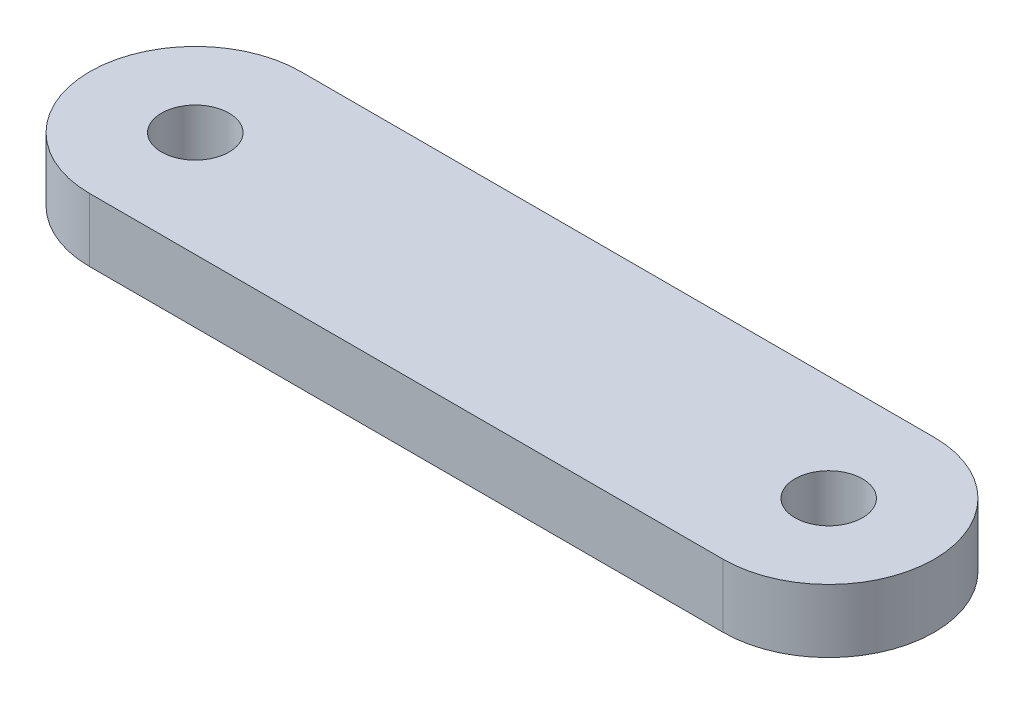
ISO-10303-21;
HEADER;
FILE_DESCRIPTION(('STEP AP214'),'2;1');
FILE_NAME('part.step','',(''),(''),'','','');
FILE_SCHEMA(('AUTOMOTIVE_DESIGN { 1 0 10303 214 1 1 1 1 }'));
ENDSEC;
DATA;
#1=APPLICATION_CONTEXT('core data for automotive mechanical design processes');
#2=APPLICATION_PROTOCOL_DEFINITION('international standard','automotive_design',2000,#1);
#3=PRODUCT_CONTEXT('',#1,'mechanical');
#4=PRODUCT('Part','Part','',(#3));
#5=PRODUCT_RELATED_PRODUCT_CATEGORY('part','',(#4));
#6=PRODUCT_DEFINITION_FORMATION('','',#4);
#7=PRODUCT_DEFINITION_CONTEXT('part definition',#1,'design');
#8=PRODUCT_DEFINITION('design','',#6,#7);
#9=PRODUCT_DEFINITION_SHAPE('','',#8);
#10=(LENGTH_UNIT() NAMED_UNIT(*) SI_UNIT(.MILLI.,.METRE.));
#11=(NAMED_UNIT(*) PLANE_ANGLE_UNIT() SI_UNIT($,.RADIAN.));
#12=(NAMED_UNIT(*) SI_UNIT($,.STERADIAN.) SOLID_ANGLE_UNIT());
#13=UNCERTAINTY_MEASURE_WITH_UNIT(LENGTH_MEASURE(1.E-05),#10,'distance_accuracy_value','');
#14=(GEOMETRIC_REPRESENTATION_CONTEXT(3) GLOBAL_UNCERTAINTY_ASSIGNED_CONTEXT((#13)) GLOBAL_UNIT_ASSIGNED_CONTEXT((#10,
#11,#12)) REPRESENTATION_CONTEXT('',''));
#15=CARTESIAN_POINT('',(0.,0.,0.));
#16=DIRECTION('',(0.,0.,1.));
#17=DIRECTION('',(1.,0.,0.));
#18=AXIS2_PLACEMENT_3D('',#15,#16,#17);
#19=CARTESIAN_POINT('',(-30.,3.,0.));
#20=DIRECTION('',(0.,1.,0.));
#21=DIRECTION('',(0.,0.,1.));
#22=AXIS2_PLACEMENT_3D('',#19,#20,#21);
#23=PLANE('',#22);
#24=CARTESIAN_POINT('',(-30.,3.,0.));
#25=DIRECTION('',(0.,1.,0.));
#26=DIRECTION('',(0.,0.,1.));
#27=AXIS2_PLACEMENT_3D('',#24,#25,#26);
#28=CIRCLE('',#27,1.6);
#29=CARTESIAN_POINT('',(-30.,3.,1.6));
#30=VERTEX_POINT('',#29);
#31=EDGE_CURVE('E102',#30,#30,#28,.T.);
#32=ORIENTED_EDGE('',*,*,#31,.F.);
#33=EDGE_LOOP('',(#32));
#34=FACE_BOUND('',#33,.T.);
#35=CARTESIAN_POINT('',(-30.,3.,0.));
#36=DIRECTION('',(0.,1.,0.));
#37=DIRECTION('',(0.,0.,1.));
#38=AXIS2_PLACEMENT_3D('',#35,#36,#37);
#39=CIRCLE('',#38,5.);
#40=CARTESIAN_POINT('',(-30.,3.,-5.));
#41=VERTEX_POINT('',#40);
#42=CARTESIAN_POINT('',(-30.,3.,5.));
#43=VERTEX_POINT('',#42);
#44=EDGE_CURVE('E87',#41,#43,#39,.T.);
#45=ORIENTED_EDGE('',*,*,#44,.T.);
#46=DIRECTION('',(1.,0.,0.));
#47=VECTOR('',#46,1.);
#48=CARTESIAN_POINT('',(-30.,3.,5.));
#49=LINE('',#48,#47);
#50=CARTESIAN_POINT('',(0.,3.,5.));
#51=VERTEX_POINT('',#50);
#52=EDGE_CURVE('E82',#43,#51,#49,.T.);
#53=ORIENTED_EDGE('',*,*,#52,.T.);
#54=CARTESIAN_POINT('',(0.,3.,0.));
#55=DIRECTION('',(0.,1.,0.));
#56=DIRECTION('',(0.,0.,1.));
#57=AXIS2_PLACEMENT_3D('',#54,#55,#56);
#58=CIRCLE('',#57,5.);
#59=CARTESIAN_POINT('',(0.,3.,-5.));
#60=VERTEX_POINT('',#59);
#61=EDGE_CURVE('E85',#51,#60,#58,.T.);
#62=ORIENTED_EDGE('',*,*,#61,.T.);
#63=DIRECTION('',(-1.,0.,0.));
#64=VECTOR('',#63,1.);
#65=CARTESIAN_POINT('',(-30.,3.,-5.));
#66=LINE('',#65,#64);
#67=EDGE_CURVE('E52',#60,#41,#66,.T.);
#68=ORIENTED_EDGE('',*,*,#67,.T.);
#69=EDGE_LOOP('',(#45,#53,#62,#68));
#70=FACE_BOUND('',#69,.T.);
#71=CARTESIAN_POINT('',(0.,3.,0.));
#72=DIRECTION('',(0.,1.,0.));
#73=DIRECTION('',(0.,0.,1.));
#74=AXIS2_PLACEMENT_3D('',#71,#72,#73);
#75=CIRCLE('',#74,1.6);
#76=CARTESIAN_POINT('',(0.,3.,1.6));
#77=VERTEX_POINT('',#76);
#78=EDGE_CURVE('E117',#77,#77,#75,.T.);
#79=ORIENTED_EDGE('',*,*,#78,.F.);
#80=EDGE_LOOP('',(#79));
#81=FACE_BOUND('',#80,.T.);
#82=ADVANCED_FACE('F35',(#34,#70,#81),#23,.T.);
#83=CARTESIAN_POINT('',(-30.,0.,0.));
#84=DIRECTION('',(0.,1.,0.));
#85=DIRECTION('',(0.,0.,1.));
#86=AXIS2_PLACEMENT_3D('',#83,#84,#85);
#87=PLANE('',#86);
#88=CARTESIAN_POINT('',(-30.,0.,0.));
#89=DIRECTION('',(0.,1.,0.));
#90=DIRECTION('',(0.,0.,1.));
#91=AXIS2_PLACEMENT_3D('',#88,#89,#90);
#92=CIRCLE('',#91,1.6);
#93=CARTESIAN_POINT('',(-30.,0.,1.6));
#94=VERTEX_POINT('',#93);
#95=EDGE_CURVE('E114',#94,#94,#92,.T.);
#96=ORIENTED_EDGE('',*,*,#95,.T.);
#97=EDGE_LOOP('',(#96));
#98=FACE_BOUND('',#97,.T.);
#99=CARTESIAN_POINT('',(-30.,0.,0.));
#100=DIRECTION('',(0.,1.,0.));
#101=DIRECTION('',(0.,0.,1.));
#102=AXIS2_PLACEMENT_3D('',#99,#100,#101);
#103=CIRCLE('',#102,5.);
#104=CARTESIAN_POINT('',(-30.,0.,-5.));
#105=VERTEX_POINT('',#104);
#106=CARTESIAN_POINT('',(-30.,0.,5.));
#107=VERTEX_POINT('',#106);
#108=EDGE_CURVE('E99',#105,#107,#103,.T.);
#109=ORIENTED_EDGE('',*,*,#108,.F.);
#110=DIRECTION('',(-1.,0.,0.));
#111=VECTOR('',#110,1.);
#112=CARTESIAN_POINT('',(-30.,0.,-5.));
#113=LINE('',#112,#111);
#114=CARTESIAN_POINT('',(0.,0.,-5.));
#115=VERTEX_POINT('',#114);
#116=EDGE_CURVE('E75',#115,#105,#113,.T.);
#117=ORIENTED_EDGE('',*,*,#116,.F.);
#118=CARTESIAN_POINT('',(0.,0.,0.));
#119=DIRECTION('',(0.,1.,0.));
#120=DIRECTION('',(0.,0.,1.));
#121=AXIS2_PLACEMENT_3D('',#118,#119,#120);
#122=CIRCLE('',#121,5.);
#123=CARTESIAN_POINT('',(0.,0.,5.));
#124=VERTEX_POINT('',#123);
#125=EDGE_CURVE('E69',#124,#115,#122,.T.);
#126=ORIENTED_EDGE('',*,*,#125,.F.);
#127=DIRECTION('',(1.,0.,0.));
#128=VECTOR('',#127,1.);
#129=CARTESIAN_POINT('',(-30.,0.,5.));
#130=LINE('',#129,#128);
#131=EDGE_CURVE('E91',#107,#124,#130,.T.);
#132=ORIENTED_EDGE('',*,*,#131,.F.);
#133=EDGE_LOOP('',(#109,#117,#126,#132));
#134=FACE_BOUND('',#133,.T.);
#135=CARTESIAN_POINT('',(0.,0.,0.));
#136=DIRECTION('',(0.,1.,0.));
#137=DIRECTION('',(0.,0.,1.));
#138=AXIS2_PLACEMENT_3D('',#135,#136,#137);
#139=CIRCLE('',#138,1.6);
#140=CARTESIAN_POINT('',(0.,0.,1.6));
#141=VERTEX_POINT('',#140);
#142=EDGE_CURVE('E120',#141,#141,#139,.T.);
#143=ORIENTED_EDGE('',*,*,#142,.T.);
#144=EDGE_LOOP('',(#143));
#145=FACE_BOUND('',#144,.T.);
#146=ADVANCED_FACE('F110',(#98,#134,#145),#87,.F.);
#147=CARTESIAN_POINT('',(-30.,3.,0.));
#148=DIRECTION('',(0.,-1.,0.));
#149=DIRECTION('',(0.,0.,-1.));
#150=AXIS2_PLACEMENT_3D('',#147,#148,#149);
#151=CYLINDRICAL_SURFACE('',#150,5.);
#152=ORIENTED_EDGE('',*,*,#108,.T.);
#153=DIRECTION('',(0.,-1.,0.));
#154=VECTOR('',#153,1.);
#155=CARTESIAN_POINT('',(-30.,3.,5.));
#156=LINE('',#155,#154);
#157=EDGE_CURVE('E11',#43,#107,#156,.T.);
#158=ORIENTED_EDGE('',*,*,#157,.F.);
#159=ORIENTED_EDGE('',*,*,#44,.F.);
#160=DIRECTION('',(0.,-1.,0.));
#161=VECTOR('',#160,1.);
#162=CARTESIAN_POINT('',(-30.,3.,-5.));
#163=LINE('',#162,#161);
#164=EDGE_CURVE('E95',#41,#105,#163,.T.);
#165=ORIENTED_EDGE('',*,*,#164,.T.);
#166=EDGE_LOOP('',(#152,#158,#159,#165));
#167=FACE_BOUND('',#166,.T.);
#168=ADVANCED_FACE('F37',(#167),#151,.T.);
#169=CARTESIAN_POINT('',(-30.,3.,5.));
#170=DIRECTION('',(0.,0.,-1.));
#171=DIRECTION('',(-1.,0.,0.));
#172=AXIS2_PLACEMENT_3D('',#169,#170,#171);
#173=PLANE('',#172);
#174=ORIENTED_EDGE('',*,*,#131,.T.);
#175=DIRECTION('',(0.,-1.,0.));
#176=VECTOR('',#175,1.);
#177=CARTESIAN_POINT('',(0.,3.,5.));
#178=LINE('',#177,#176);
#179=EDGE_CURVE('E44',#51,#124,#178,.T.);
#180=ORIENTED_EDGE('',*,*,#179,.F.);
#181=ORIENTED_EDGE('',*,*,#52,.F.);
#182=ORIENTED_EDGE('',*,*,#157,.T.);
#183=EDGE_LOOP('',(#174,#180,#181,#182));
#184=FACE_BOUND('',#183,.T.);
#185=ADVANCED_FACE('F90',(#184),#173,.F.);
#186=CARTESIAN_POINT('',(0.,3.,0.));
#187=DIRECTION('',(0.,-1.,0.));
#188=DIRECTION('',(0.,0.,-1.));
#189=AXIS2_PLACEMENT_3D('',#186,#187,#188);
#190=CYLINDRICAL_SURFACE('',#189,5.);
#191=ORIENTED_EDGE('',*,*,#125,.T.);
#192=DIRECTION('',(0.,-1.,0.));
#193=VECTOR('',#192,1.);
#194=CARTESIAN_POINT('',(0.,3.,-5.));
#195=LINE('',#194,#193);
#196=EDGE_CURVE('E92',#60,#115,#195,.T.);
#197=ORIENTED_EDGE('',*,*,#196,.F.);
#198=ORIENTED_EDGE('',*,*,#61,.F.);
#199=ORIENTED_EDGE('',*,*,#179,.T.);
#200=EDGE_LOOP('',(#191,#197,#198,#199));
#201=FACE_BOUND('',#200,.T.);
#202=ADVANCED_FACE('F93',(#201),#190,.T.);
#203=CARTESIAN_POINT('',(-30.,3.,-5.));
#204=DIRECTION('',(0.,0.,1.));
#205=DIRECTION('',(1.,0.,0.));
#206=AXIS2_PLACEMENT_3D('',#203,#204,#205);
#207=PLANE('',#206);
#208=ORIENTED_EDGE('',*,*,#116,.T.);
#209=ORIENTED_EDGE('',*,*,#164,.F.);
#210=ORIENTED_EDGE('',*,*,#67,.F.);
#211=ORIENTED_EDGE('',*,*,#196,.T.);
#212=EDGE_LOOP('',(#208,#209,#210,#211));
#213=FACE_BOUND('',#212,.T.);
#214=ADVANCED_FACE('F107',(#213),#207,.F.);
#215=CARTESIAN_POINT('',(-30.,3.,0.));
#216=DIRECTION('',(0.,-1.,0.));
#217=DIRECTION('',(0.,0.,-1.));
#218=AXIS2_PLACEMENT_3D('',#215,#216,#217);
#219=CYLINDRICAL_SURFACE('',#218,1.6);
#220=ORIENTED_EDGE('',*,*,#31,.T.);
#221=EDGE_LOOP('',(#220));
#222=FACE_BOUND('',#221,.T.);
#223=ORIENTED_EDGE('',*,*,#95,.F.);
#224=EDGE_LOOP('',(#223));
#225=FACE_BOUND('',#224,.T.);
#226=ADVANCED_FACE('F138',(#222,#225),#219,.F.);
#227=CARTESIAN_POINT('',(0.,3.,0.));
#228=DIRECTION('',(0.,-1.,0.));
#229=DIRECTION('',(0.,0.,-1.));
#230=AXIS2_PLACEMENT_3D('',#227,#228,#229);
#231=CYLINDRICAL_SURFACE('',#230,1.6);
#232=ORIENTED_EDGE('',*,*,#78,.T.);
#233=EDGE_LOOP('',(#232));
#234=FACE_BOUND('',#233,.T.);
#235=ORIENTED_EDGE('',*,*,#142,.F.);
#236=EDGE_LOOP('',(#235));
#237=FACE_BOUND('',#236,.T.);
#238=ADVANCED_FACE('F126',(#234,#237),#231,.F.);
#239=CLOSED_SHELL('',(#82,#146,#168,#185,#202,#214,#226,#238));
#240=MANIFOLD_SOLID_BREP('B2',#239);
#241=ADVANCED_BREP_SHAPE_REPRESENTATION('',(#18,#240),#14);
#242=SHAPE_DEFINITION_REPRESENTATION(#9,#241);
ENDSEC;
END-ISO-10303-21;
